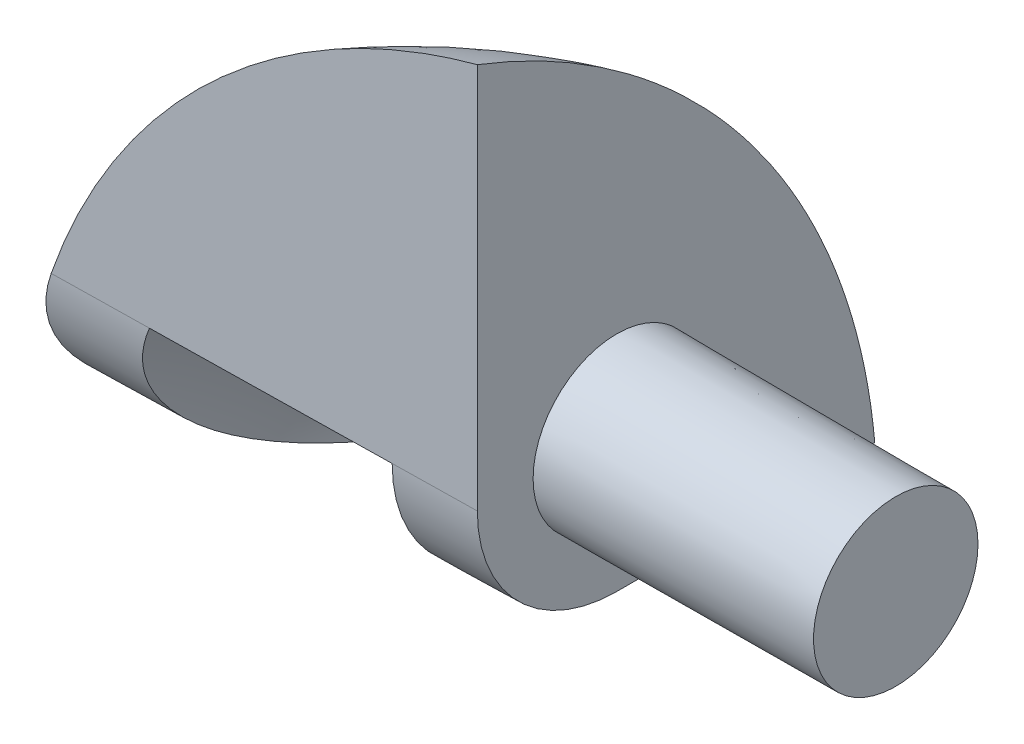
ISO-10303-21;
HEADER;
FILE_DESCRIPTION(('STEP AP214'),'2;1');
FILE_NAME('part.step','',(''),(''),'','','');
FILE_SCHEMA(('AUTOMOTIVE_DESIGN { 1 0 10303 214 1 1 1 1 }'));
ENDSEC;
DATA;
#1=APPLICATION_CONTEXT('core data for automotive mechanical design processes');
#2=APPLICATION_PROTOCOL_DEFINITION('international standard','automotive_design',2000,#1);
#3=PRODUCT_CONTEXT('',#1,'mechanical');
#4=PRODUCT('Part','Part','',(#3));
#5=PRODUCT_RELATED_PRODUCT_CATEGORY('part','',(#4));
#6=PRODUCT_DEFINITION_FORMATION('','',#4);
#7=PRODUCT_DEFINITION_CONTEXT('part definition',#1,'design');
#8=PRODUCT_DEFINITION('design','',#6,#7);
#9=PRODUCT_DEFINITION_SHAPE('','',#8);
#10=(LENGTH_UNIT() NAMED_UNIT(*) SI_UNIT(.MILLI.,.METRE.));
#11=(NAMED_UNIT(*) PLANE_ANGLE_UNIT() SI_UNIT($,.RADIAN.));
#12=(NAMED_UNIT(*) SI_UNIT($,.STERADIAN.) SOLID_ANGLE_UNIT());
#13=UNCERTAINTY_MEASURE_WITH_UNIT(LENGTH_MEASURE(1.E-05),#10,'distance_accuracy_value','');
#14=(GEOMETRIC_REPRESENTATION_CONTEXT(3) GLOBAL_UNCERTAINTY_ASSIGNED_CONTEXT((#13)) GLOBAL_UNIT_ASSIGNED_CONTEXT((#10,
#11,#12)) REPRESENTATION_CONTEXT('',''));
#15=CARTESIAN_POINT('',(0.,0.,0.));
#16=DIRECTION('',(0.,0.,1.));
#17=DIRECTION('',(1.,0.,0.));
#18=AXIS2_PLACEMENT_3D('',#15,#16,#17);
#19=CARTESIAN_POINT('',(-16.7,5.,-31.5));
#20=DIRECTION('',(-1.,0.,0.));
#21=DIRECTION('',(0.,0.,1.));
#22=AXIS2_PLACEMENT_3D('',#19,#20,#21);
#23=CONICAL_SURFACE('',#22,2.5,0.0174532925199433);
#24=CARTESIAN_POINT('',(-18.2,5.,-31.5));
#25=DIRECTION('',(-1.,0.,0.));
#26=DIRECTION('',(0.,0.,1.));
#27=AXIS2_PLACEMENT_3D('',#24,#25,#26);
#28=CIRCLE('',#27,2.52618259739233);
#29=CARTESIAN_POINT('',(-18.2,2.47381740260767,-31.5));
#30=VERTEX_POINT('',#29);
#31=CARTESIAN_POINT('',(-18.2,5.,-28.9738174026077));
#32=VERTEX_POINT('',#31);
#33=EDGE_CURVE('E191',#30,#32,#28,.T.);
#34=ORIENTED_EDGE('',*,*,#33,.F.);
#35=DIRECTION('',(-0.999847695156391,-0.0174524064372836,0.));
#36=VECTOR('',#35,1.);
#37=CARTESIAN_POINT('',(-16.7,2.5,-31.5));
#38=LINE('',#37,#36);
#39=CARTESIAN_POINT('',(-16.7,2.5,-31.5));
#40=VERTEX_POINT('',#39);
#41=EDGE_CURVE('E63',#30,#40,#38,.F.);
#42=ORIENTED_EDGE('',*,*,#41,.T.);
#43=CARTESIAN_POINT('',(-16.7,5.,-31.5));
#44=DIRECTION('',(-1.,0.,0.));
#45=DIRECTION('',(0.,0.,1.));
#46=AXIS2_PLACEMENT_3D('',#43,#44,#45);
#47=CIRCLE('',#46,2.5);
#48=CARTESIAN_POINT('',(-16.7,5.,-29.));
#49=VERTEX_POINT('',#48);
#50=EDGE_CURVE('E106',#40,#49,#47,.T.);
#51=ORIENTED_EDGE('',*,*,#50,.T.);
#52=DIRECTION('',(-0.999847695156391,0.,0.0174524064372835));
#53=VECTOR('',#52,1.);
#54=CARTESIAN_POINT('',(-16.7,5.,-29.));
#55=LINE('',#54,#53);
#56=EDGE_CURVE('E98',#32,#49,#55,.F.);
#57=ORIENTED_EDGE('',*,*,#56,.F.);
#58=EDGE_LOOP('',(#34,#42,#51,#57));
#59=FACE_BOUND('',#58,.T.);
#60=ADVANCED_FACE('F38',(#59),#23,.T.);
#61=CARTESIAN_POINT('',(-13.958082329,1.5,-25.));
#62=DIRECTION('',(0.,0.,1.));
#63=DIRECTION('',(1.,0.,0.));
#64=AXIS2_PLACEMENT_3D('',#61,#62,#63);
#65=SPHERICAL_SURFACE('',#64,11.5);
#66=CARTESIAN_POINT('',(-16.7,11.9274583425425,-28.9999999999999));
#67=CARTESIAN_POINT('',(-16.7,11.8149747360119,-29.2933238908898));
#68=CARTESIAN_POINT('',(-16.7,11.6900553163313,-29.5818722047106));
#69=CARTESIAN_POINT('',(-16.7,11.4163742320749,-30.1474155795178));
#70=CARTESIAN_POINT('',(-16.7,11.2676136755138,-30.4244111766622));
#71=CARTESIAN_POINT('',(-16.7,10.9474213463603,-30.9646177124004));
#72=CARTESIAN_POINT('',(-16.7,10.7760112637699,-31.2278415068803));
#73=CARTESIAN_POINT('',(-16.7,10.4116405578892,-31.7389187345353));
#74=CARTESIAN_POINT('',(-16.7,10.2186802492486,-31.9867723920439));
#75=CARTESIAN_POINT('',(-16.7,9.81249795059924,-32.465442631399));
#76=CARTESIAN_POINT('',(-16.7,9.59926831184079,-32.6962527229128));
#77=CARTESIAN_POINT('',(-16.7,9.15412050265844,-33.1390966828443));
#78=CARTESIAN_POINT('',(-16.7,8.92220192706654,-33.3511301439835));
#79=CARTESIAN_POINT('',(-16.7,8.44127459183763,-33.7549533422451));
#80=CARTESIAN_POINT('',(-16.7,8.19226201204363,-33.9467385298328));
#81=CARTESIAN_POINT('',(-16.7,7.67897278273781,-34.3086405349769));
#82=CARTESIAN_POINT('',(-16.7,7.41469667391919,-34.4787581194));
#83=CARTESIAN_POINT('',(-16.7,6.8725770992699,-34.7962256874369));
#84=CARTESIAN_POINT('',(-16.7,6.59472498254735,-34.9435608979827));
#85=CARTESIAN_POINT('',(-16.7,6.02759442693541,-35.2142792424057));
#86=CARTESIAN_POINT('',(-16.7,5.73831630339152,-35.3376630367612));
#87=CARTESIAN_POINT('',(-16.7,5.15074470468094,-35.5594723282225));
#88=CARTESIAN_POINT('',(-16.7,4.85246229506419,-35.6579271669966));
#89=CARTESIAN_POINT('',(-16.7,4.24878549795067,-35.8293324386908));
#90=CARTESIAN_POINT('',(-16.7,3.94339472432316,-35.9022955419721));
#91=CARTESIAN_POINT('',(-16.7,3.44765046985422,-35.9988730142085));
#92=CARTESIAN_POINT('',(-16.7,3.2588469553571,-36.0306378722156));
#93=CARTESIAN_POINT('',(-16.7,2.88018116477531,-36.0843808366644));
#94=CARTESIAN_POINT('',(-16.7,2.69032124793045,-36.106375566696));
#95=CARTESIAN_POINT('',(-16.7,2.5,-36.1234836038652));
#96=B_SPLINE_CURVE_WITH_KNOTS('',3,(#66,#67,#68,#69,#70,#71,#72,#73,#74,#75,#76,#77,#78,#79,#80,
#81,#82,#83,#84,#85,#86,#87,#88,#89,#90,#91,#92,#93,#94,#95),.UNSPECIFIED.,.F.,.F.,(4,2,2,2,2,2,
2,2,2,2,2,2,2,2,4),(0.,0.942168269487018,1.88429276448316,2.825521498708,3.76673649208155,
4.70830807911578,5.64990008450537,6.59170320564669,7.53347298491977,8.47585091006217,
9.41820284473481,10.3594404096497,11.3002094759421,11.8743493889636,12.4475086422601),.UNSPECIFIED.);
#97=CARTESIAN_POINT('',(-16.7,11.9274583425425,-29.));
#98=VERTEX_POINT('',#97);
#99=CARTESIAN_POINT('',(-16.7,2.5,-36.1234836038652));
#100=VERTEX_POINT('',#99);
#101=EDGE_CURVE('E111',#98,#100,#96,.T.);
#102=ORIENTED_EDGE('',*,*,#101,.T.);
#103=CARTESIAN_POINT('',(-16.7,2.5,-36.1234836038652));
#104=CARTESIAN_POINT('',(-16.8872452062743,2.49673162276698,-36.077620680697));
#105=CARTESIAN_POINT('',(-17.0732959099535,2.49348409565432,-36.0270382220764));
#106=CARTESIAN_POINT('',(-17.442617493587,2.48703756343261,-35.9165451328815));
#107=CARTESIAN_POINT('',(-17.6258882326112,2.4838385607835,-35.8566340311146));
#108=CARTESIAN_POINT('',(-18.1715121847469,2.47431465927258,-35.6628700770851));
#109=CARTESIAN_POINT('',(-18.5290599785377,2.46807363931702,-35.5151377863157));
#110=CARTESIAN_POINT('',(-19.1690859082112,2.45690194515883,-35.2119317735537));
#111=CARTESIAN_POINT('',(-19.4541465685392,2.45192619282432,-35.0618483491512));
#112=CARTESIAN_POINT('',(-20.0107431422891,2.44221076349069,-34.7381313182012));
#113=CARTESIAN_POINT('',(-20.2822742211107,2.43747117087983,-34.5644893747103));
#114=CARTESIAN_POINT('',(-20.8097016613319,2.42826489066585,-34.1949623104257));
#115=CARTESIAN_POINT('',(-21.0656001009276,2.42379816678768,-33.9990801561763));
#116=CARTESIAN_POINT('',(-21.5598808013197,2.41517046506956,-33.5865449391202));
#117=CARTESIAN_POINT('',(-21.798269641119,2.4110093723927,-33.3698997490043));
#118=CARTESIAN_POINT('',(-22.2818224875106,2.40256892606271,-32.891701784066));
#119=CARTESIAN_POINT('',(-22.5247182075281,2.39832916549902,-32.627839933715));
#120=CARTESIAN_POINT('',(-22.8694254690174,2.3923122778685,-32.2162141582252));
#121=CARTESIAN_POINT('',(-22.9809704984221,2.39036525213782,-32.0764895595169));
#122=CARTESIAN_POINT('',(-23.1973980452536,2.38658749525562,-31.7919764036784));
#123=CARTESIAN_POINT('',(-23.3022807333739,2.38475676112464,-31.6471879764343));
#124=CARTESIAN_POINT('',(-23.4037340229123,2.38298588736856,-31.5));
#125=B_SPLINE_CURVE_WITH_KNOTS('',3,(#103,#104,#105,#106,#107,#108,#109,#110,#111,#112,#113,
#114,#115,#116,#117,#118,#119,#120,#121,#122,#123,#124),.UNSPECIFIED.,.F.,.F.,(4,2,2,2,2,2,2,2,
2,2,4),(0.,0.578286557221905,1.15660233334581,2.31513173352243,3.28064642028605,
4.24650368120206,5.21223226080292,6.17759610435893,7.25183869306327,7.78806836159779,
8.3242842860378),.UNSPECIFIED.);
#126=CARTESIAN_POINT('',(-23.4037340229123,2.38298588736856,-31.5));
#127=VERTEX_POINT('',#126);
#128=EDGE_CURVE('E126',#100,#127,#125,.T.);
#129=ORIENTED_EDGE('',*,*,#128,.T.);
#130=CARTESIAN_POINT('',(-23.4037340229123,2.38298588736856,-31.5));
#131=CARTESIAN_POINT('',(-23.4527827392308,2.38213938022257,-31.428836156152));
#132=CARTESIAN_POINT('',(-23.5008444739339,2.38419683033693,-31.3569907497129));
#133=CARTESIAN_POINT('',(-23.594780722592,2.39448790662518,-31.2122007167748));
#134=CARTESIAN_POINT('',(-23.6406525183468,2.40272900643142,-31.1392548648878));
#135=CARTESIAN_POINT('',(-23.7749148998951,2.43738510924359,-30.9187226373568));
#136=CARTESIAN_POINT('',(-23.8594762120068,2.47374838065332,-30.7701315732489));
#137=CARTESIAN_POINT('',(-24.0014223127263,2.56632627347713,-30.5013624535778));
#138=CARTESIAN_POINT('',(-24.0609751982907,2.61797951799205,-30.3807438028091));
#139=CARTESIAN_POINT('',(-24.1687369069309,2.74156264235544,-30.1450507673087));
#140=CARTESIAN_POINT('',(-24.2169714323613,2.81344574973601,-30.029964302174));
#141=CARTESIAN_POINT('',(-24.2794516634236,2.93645310941198,-29.864276979857));
#142=CARTESIAN_POINT('',(-24.2986971040507,2.98021764065055,-29.8099765917054));
#143=CARTESIAN_POINT('',(-24.3335507522133,3.0726036615018,-29.7044429403565));
#144=CARTESIAN_POINT('',(-24.3491607948936,3.12122268278624,-29.6532081394029));
#145=CARTESIAN_POINT('',(-24.3765228688736,3.22305594253835,-29.5543821656061));
#146=CARTESIAN_POINT('',(-24.3882744231647,3.27627074813704,-29.5067914438223));
#147=CARTESIAN_POINT('',(-24.4077384079287,3.38685948176097,-29.4158436595324));
#148=CARTESIAN_POINT('',(-24.415451425025,3.4442328043559,-29.3724859828942));
#149=CARTESIAN_POINT('',(-24.4309285911549,3.60718538523691,-29.2597214954034));
#150=CARTESIAN_POINT('',(-24.4343907800481,3.71664089220356,-29.1951724066981));
#151=CARTESIAN_POINT('',(-24.428306759542,3.94344935145485,-29.0828901177299));
#152=CARTESIAN_POINT('',(-24.4187618624023,4.06080150592662,-29.0351552217273));
#153=CARTESIAN_POINT('',(-24.3879654712519,4.29369659118688,-28.959454152577));
#154=CARTESIAN_POINT('',(-24.3673140029209,4.40904373136801,-28.9306297677945));
#155=CARTESIAN_POINT('',(-24.3156069156726,4.64017971452942,-28.8891355855114));
#156=CARTESIAN_POINT('',(-24.2845646681771,4.75596780171608,-28.8764451261883));
#157=CARTESIAN_POINT('',(-24.2422019202093,4.89217749781347,-28.8704697802564));
#158=CARTESIAN_POINT('',(-24.2352903799775,4.91382683357402,-28.8697932256311));
#159=CARTESIAN_POINT('',(-24.2211543183433,4.95700055151172,-28.8689810258468));
#160=CARTESIAN_POINT('',(-24.2139302377448,4.97852506405308,-28.8688446424588));
#161=CARTESIAN_POINT('',(-24.2065480738307,5.,-28.8689727159845));
#162=B_SPLINE_CURVE_WITH_KNOTS('',3,(#130,#131,#132,#133,#134,#135,#136,#137,#138,#139,#140,
#141,#142,#143,#144,#145,#146,#147,#148,#149,#150,#151,#152,#153,#154,#155,#156,#157,#158,#159,
#160,#161),.UNSPECIFIED.,.F.,.F.,(4,2,2,2,2,2,2,2,2,2,2,2,2,2,2,4),(0.,0.259173587881905,
0.518660921604503,1.04012398649634,1.47075131257005,1.90039107251478,2.11717007883785,
2.33383941700997,2.55053553101812,2.76720015978991,3.14639592992247,3.525553446561,
3.88602774080967,4.24603992908952,4.31424499492393,4.38235681556486),.UNSPECIFIED.);
#163=CARTESIAN_POINT('',(-24.2065480738307,5.,-28.8689727159845));
#164=VERTEX_POINT('',#163);
#165=EDGE_CURVE('E152',#127,#164,#162,.T.);
#166=ORIENTED_EDGE('',*,*,#165,.T.);
#167=CARTESIAN_POINT('',(-24.2065480738307,5.,-28.8689727159845));
#168=CARTESIAN_POINT('',(-24.1409163307733,5.19093183028949,-28.8701183223209));
#169=CARTESIAN_POINT('',(-24.0699019755796,5.38001187342618,-28.8713578825017));
#170=CARTESIAN_POINT('',(-23.9173622675716,5.75387253722699,-28.8740204730091));
#171=CARTESIAN_POINT('',(-23.8358373777454,5.93865334684895,-28.8754434952542));
#172=CARTESIAN_POINT('',(-23.6625263068449,6.30333387018309,-28.8784686512496));
#173=CARTESIAN_POINT('',(-23.570740280212,6.48323365730944,-28.880070782304));
#174=CARTESIAN_POINT('',(-23.3773308374099,6.83734442788388,-28.8834467566858));
#175=CARTESIAN_POINT('',(-23.275720975064,7.01156281804577,-28.8852203634304));
#176=CARTESIAN_POINT('',(-23.0628779581472,7.35401746544034,-28.8889355521102));
#177=CARTESIAN_POINT('',(-22.9516449295223,7.52225380092414,-28.890877131847));
#178=CARTESIAN_POINT('',(-22.7199176955839,7.85220278329359,-28.894921945761));
#179=CARTESIAN_POINT('',(-22.59942358415,8.0139154962839,-28.8970251782996));
#180=CARTESIAN_POINT('',(-22.2869719275582,8.40953989096982,-28.9024790422523));
#181=CARTESIAN_POINT('',(-22.0894311202744,8.63907738558853,-28.9059271298694));
#182=CARTESIAN_POINT('',(-21.6756185560756,9.08080279680634,-28.9131502550456));
#183=CARTESIAN_POINT('',(-21.4593360202857,9.29298059116468,-28.9169254807507));
#184=CARTESIAN_POINT('',(-21.009703910905,9.69831620045957,-28.9247738384137));
#185=CARTESIAN_POINT('',(-20.7763577637937,9.89147781578456,-28.9288469105623));
#186=CARTESIAN_POINT('',(-20.2943408802493,10.257358561905,-28.9372605465611));
#187=CARTESIAN_POINT('',(-20.0456779657289,10.4300879974532,-28.9416009738793));
#188=CARTESIAN_POINT('',(-19.552371557452,10.7427845181482,-28.9502116692653));
#189=CARTESIAN_POINT('',(-19.3086385231492,10.884190990053,-28.9544660452042));
#190=CARTESIAN_POINT('',(-18.8108464809457,11.1474545064665,-28.9631550376216));
#191=CARTESIAN_POINT('',(-18.5567879738438,11.2693124976869,-28.9675896453586));
#192=CARTESIAN_POINT('',(-18.0396653967386,11.4928276617319,-28.9766160535178));
#193=CARTESIAN_POINT('',(-17.7765933651459,11.5944664060857,-28.9812079929101));
#194=CARTESIAN_POINT('',(-17.2432690056883,11.7768142660819,-28.9905172042322));
#195=CARTESIAN_POINT('',(-16.9730160291281,11.8575214837266,-28.9952344874851));
#196=CARTESIAN_POINT('',(-16.7,11.9274583425425,-29.));
#197=B_SPLINE_CURVE_WITH_KNOTS('',3,(#167,#168,#169,#170,#171,#172,#173,#174,#175,#176,#177,
#178,#179,#180,#181,#182,#183,#184,#185,#186,#187,#188,#189,#190,#191,#192,#193,#194,#195,#196),
.UNSPECIFIED.,.F.,.F.,(4,2,2,2,2,2,2,2,2,2,2,2,2,2,4),(0.,0.605620228519319,1.21121378863563,
1.81679823512394,2.42155877421638,3.02631139953673,3.63105789528587,4.53848470492544,
5.44643690874938,6.35420728814881,7.26151787339915,8.10610689494332,8.95065500160633,
9.79596936493327,10.6413603516442),.UNSPECIFIED.);
#198=EDGE_CURVE('E104',#164,#98,#197,.T.);
#199=ORIENTED_EDGE('',*,*,#198,.T.);
#200=EDGE_LOOP('',(#102,#129,#166,#199));
#201=FACE_BOUND('',#200,.T.);
#202=ADVANCED_FACE('F40',(#201),#65,.T.);
#203=CARTESIAN_POINT('',(-16.7,1.49999999999994,-24.9999999999999));
#204=DIRECTION('',(-1.,0.,0.));
#205=DIRECTION('',(0.,0.,1.));
#206=AXIS2_PLACEMENT_3D('',#203,#204,#205);
#207=PLANE('',#206);
#208=CARTESIAN_POINT('',(-16.7,5.,-31.5));
#209=DIRECTION('',(-1.,0.,0.));
#210=DIRECTION('',(0.,0.,1.));
#211=AXIS2_PLACEMENT_3D('',#208,#209,#210);
#212=CIRCLE('',#211,1.5);
#213=CARTESIAN_POINT('',(-16.7,5.,-30.));
#214=VERTEX_POINT('',#213);
#215=EDGE_CURVE('E11',#214,#214,#212,.F.);
#216=ORIENTED_EDGE('',*,*,#215,.F.);
#217=EDGE_LOOP('',(#216));
#218=FACE_BOUND('',#217,.T.);
#219=ORIENTED_EDGE('',*,*,#101,.F.);
#220=DIRECTION('',(0.,1.,0.));
#221=VECTOR('',#220,1.);
#222=CARTESIAN_POINT('',(-16.7,5.,-29.));
#223=LINE('',#222,#221);
#224=EDGE_CURVE('E95',#49,#98,#223,.T.);
#225=ORIENTED_EDGE('',*,*,#224,.F.);
#226=ORIENTED_EDGE('',*,*,#50,.F.);
#227=DIRECTION('',(0.,0.,1.));
#228=VECTOR('',#227,1.);
#229=CARTESIAN_POINT('',(-16.7,2.5,-36.1234836038652));
#230=LINE('',#229,#228);
#231=EDGE_CURVE('E47',#100,#40,#230,.T.);
#232=ORIENTED_EDGE('',*,*,#231,.F.);
#233=EDGE_LOOP('',(#219,#225,#226,#232));
#234=FACE_BOUND('',#233,.T.);
#235=ADVANCED_FACE('F109',(#218,#234),#207,.F.);
#236=CARTESIAN_POINT('',(-16.7,5.,-29.));
#237=DIRECTION('',(0.0174524064372835,0.,0.999847695156391));
#238=DIRECTION('',(0.999847695156391,0.,-0.0174524064372836));
#239=AXIS2_PLACEMENT_3D('',#236,#237,#238);
#240=PLANE('',#239);
#241=ORIENTED_EDGE('',*,*,#198,.F.);
#242=CARTESIAN_POINT('',(-22.475495682113,4.99999999999999,-28.8991883478761));
#243=VERTEX_POINT('',#242);
#244=EDGE_CURVE('E103',#164,#243,#55,.F.);
#245=ORIENTED_EDGE('',*,*,#244,.T.);
#246=DIRECTION('',(-0.999847695156391,0.,0.0174524064372835));
#247=VECTOR('',#246,1.);
#248=CARTESIAN_POINT('',(-16.7,5.,-29.));
#249=LINE('',#248,#247);
#250=EDGE_CURVE('E102',#243,#32,#249,.F.);
#251=ORIENTED_EDGE('',*,*,#250,.T.);
#252=ORIENTED_EDGE('',*,*,#56,.T.);
#253=ORIENTED_EDGE('',*,*,#224,.T.);
#254=EDGE_LOOP('',(#241,#245,#251,#252,#253));
#255=FACE_BOUND('',#254,.T.);
#256=ADVANCED_FACE('F99',(#255),#240,.T.);
#257=CARTESIAN_POINT('',(-21.5019946170281,2.41618087217482,-31.5));
#258=VERTEX_POINT('',#257);
#259=EDGE_CURVE('E107',#127,#258,#38,.F.);
#260=ORIENTED_EDGE('',*,*,#259,.T.);
#261=CARTESIAN_POINT('',(-21.5019946170281,2.41618087217482,-31.5));
#262=CARTESIAN_POINT('',(-21.7818116813577,2.4074659707164,-31.1798958378559));
#263=CARTESIAN_POINT('',(-22.0442483914631,2.46875454492175,-30.8196067243731));
#264=CARTESIAN_POINT('',(-22.3851657770192,2.70735908191712,-30.2532198990124));
#265=CARTESIAN_POINT('',(-22.4956158253154,2.83135020631474,-30.0408397312194));
#266=CARTESIAN_POINT('',(-22.6614049352204,3.15369986034612,-29.6463864459728));
#267=CARTESIAN_POINT('',(-22.7164135789713,3.35249467420466,-29.4645003580943));
#268=CARTESIAN_POINT('',(-22.7523234859087,3.77306213369534,-29.1892861332551));
#269=CARTESIAN_POINT('',(-22.7417385813703,3.98872313987716,-29.0876522275608));
#270=CARTESIAN_POINT('',(-22.6706208718948,4.41981299448197,-28.9516924034619));
#271=CARTESIAN_POINT('',(-22.6126402917912,4.63470236793792,-28.9142234241961));
#272=CARTESIAN_POINT('',(-22.5173540884124,4.89593154465526,-28.8999747427199));
#273=CARTESIAN_POINT('',(-22.4969602801363,4.94826230254953,-28.8987680123767));
#274=CARTESIAN_POINT('',(-22.475495682113,4.99999999999999,-28.8991883478761));
#275=B_SPLINE_CURVE_WITH_KNOTS('',3,(#261,#262,#263,#264,#265,#266,#267,#268,#269,#270,#271,
#272,#273,#274),.UNSPECIFIED.,.F.,.F.,(4,2,2,2,2,2,4),(0.,1.29190833492842,2.08984047789364,
2.89250047973878,3.59336373129673,4.25879407537636,4.42712452136552),.UNSPECIFIED.);
#276=EDGE_CURVE('E164',#258,#243,#275,.T.);
#277=ORIENTED_EDGE('',*,*,#276,.T.);
#278=ORIENTED_EDGE('',*,*,#244,.F.);
#279=ORIENTED_EDGE('',*,*,#165,.F.);
#280=EDGE_LOOP('',(#260,#277,#278,#279));
#281=FACE_BOUND('',#280,.T.);
#282=ADVANCED_FACE('F143',(#281),#23,.T.);
#283=CARTESIAN_POINT('',(-16.7,2.5,-36.1234836038652));
#284=DIRECTION('',(0.0174524064372835,-0.999847695156391,0.));
#285=DIRECTION('',(0.999847695156391,0.0174524064372836,0.));
#286=AXIS2_PLACEMENT_3D('',#283,#284,#285);
#287=PLANE('',#286);
#288=DIRECTION('',(0.,0.,-1.));
#289=VECTOR('',#288,1.);
#290=CARTESIAN_POINT('',(-18.2,2.47381740260767,-36.1234836038652));
#291=LINE('',#290,#289);
#292=CARTESIAN_POINT('',(-18.2,2.47381740260767,-34.0032113236798));
#293=VERTEX_POINT('',#292);
#294=EDGE_CURVE('E247',#293,#30,#291,.F.);
#295=ORIENTED_EDGE('',*,*,#294,.F.);
#296=CARTESIAN_POINT('',(-22.0127525030782,2.40726556011122,-30.8565482658517));
#297=CARTESIAN_POINT('',(-21.3217344806232,2.41932732455974,-31.7871677568244));
#298=CARTESIAN_POINT('',(-20.5246425779682,2.43324061547434,-32.5639520794253));
#299=CARTESIAN_POINT('',(-18.7183110122581,2.46477025023569,-33.8098503878834));
#300=CARTESIAN_POINT('',(-17.7090713492031,2.48238659408245,-34.2789643737406));
#301=CARTESIAN_POINT('',(-16.5937578059481,2.50185446439529,-34.594243191226));
#302=B_SPLINE_CURVE_WITH_KNOTS('',3,(#296,#297,#298,#299,#300,#301),.UNSPECIFIED.,.F.,.F.,(4,2,
4),(0.,3.33923444565174,6.67846889130348),.UNSPECIFIED.);
#303=EDGE_CURVE('E170',#293,#258,#302,.F.);
#304=ORIENTED_EDGE('',*,*,#303,.T.);
#305=ORIENTED_EDGE('',*,*,#259,.F.);
#306=ORIENTED_EDGE('',*,*,#128,.F.);
#307=ORIENTED_EDGE('',*,*,#231,.T.);
#308=ORIENTED_EDGE('',*,*,#41,.F.);
#309=EDGE_LOOP('',(#295,#304,#305,#306,#307,#308));
#310=FACE_BOUND('',#309,.T.);
#311=ADVANCED_FACE('F139',(#310),#287,.T.);
#312=CARTESIAN_POINT('',(-16.7,5.,-31.5));
#313=DIRECTION('',(-1.,0.,0.));
#314=DIRECTION('',(0.,0.,-1.));
#315=AXIS2_PLACEMENT_3D('',#312,#313,#314);
#316=CONICAL_SURFACE('',#315,1.5,0.005235987755983);
#317=CARTESIAN_POINT('',(-11.7,5.,-31.5));
#318=DIRECTION('',(1.,0.,0.));
#319=DIRECTION('',(0.,0.,-1.));
#320=AXIS2_PLACEMENT_3D('',#317,#318,#319);
#321=CIRCLE('',#320,1.4738198219715);
#322=CARTESIAN_POINT('',(-11.7,5.,-32.9738198219715));
#323=VERTEX_POINT('',#322);
#324=EDGE_CURVE('E116',#323,#323,#321,.T.);
#325=ORIENTED_EDGE('',*,*,#324,.F.);
#326=EDGE_LOOP('',(#325));
#327=FACE_BOUND('',#326,.T.);
#328=ORIENTED_EDGE('',*,*,#215,.T.);
#329=EDGE_LOOP('',(#328));
#330=FACE_BOUND('',#329,.T.);
#331=ADVANCED_FACE('F137',(#327,#330),#316,.T.);
#332=CARTESIAN_POINT('',(-11.7,5.,-31.5));
#333=DIRECTION('',(1.,0.,0.));
#334=DIRECTION('',(0.,0.,-1.));
#335=AXIS2_PLACEMENT_3D('',#332,#333,#334);
#336=PLANE('',#335);
#337=ORIENTED_EDGE('',*,*,#324,.T.);
#338=EDGE_LOOP('',(#337));
#339=FACE_BOUND('',#338,.T.);
#340=ADVANCED_FACE('F233',(#339),#336,.T.);
#341=CARTESIAN_POINT('',(-16.7,5.,-29.));
#342=DIRECTION('',(0.,1.,0.));
#343=DIRECTION('',(-0.999847695156391,0.,0.0174524064372835));
#344=AXIS2_PLACEMENT_3D('',#341,#342,#343);
#345=PLANE('',#344);
#346=ORIENTED_EDGE('',*,*,#250,.F.);
#347=CARTESIAN_POINT('',(-21.6021284172571,5.,-30.4146615222562));
#348=CARTESIAN_POINT('',(-22.2091847976138,5.,-29.5564563365036));
#349=CARTESIAN_POINT('',(-22.6729947491403,5.,-28.5922145609624));
#350=CARTESIAN_POINT('',(-23.2540203488889,4.99999999999999,-26.5662024856615));
#351=CARTESIAN_POINT('',(-23.3712359971111,4.99999999999999,-25.5044321859018));
#352=CARTESIAN_POINT('',(-23.2479506032991,4.99999999999998,-23.4015064713377));
#353=CARTESIAN_POINT('',(-23.0074495612647,4.99999999999998,-22.3603510565332));
#354=CARTESIAN_POINT('',(-22.1952846941455,4.99999999999998,-20.416456328432));
#355=CARTESIAN_POINT('',(-21.6236208690605,4.99999999999997,-19.5137170151351));
#356=CARTESIAN_POINT('',(-20.2137314510007,4.99999999999997,-17.9483192714992));
#357=CARTESIAN_POINT('',(-19.3755058580258,4.99999999999998,-17.28566084116));
#358=CARTESIAN_POINT('',(-17.5269562205701,4.99999999999996,-16.2751646458484));
#359=CARTESIAN_POINT('',(-16.5166321760892,4.99999999999992,-15.9273268808761));
#360=CARTESIAN_POINT('',(-14.43780279476,4.99999999999992,-15.5856800292226));
#361=CARTESIAN_POINT('',(-13.3692974579115,4.99999999999996,-15.5918709425414));
#362=CARTESIAN_POINT('',(-11.2945684750049,4.99999999999998,-15.957585623651));
#363=CARTESIAN_POINT('',(-10.2883448289468,4.99999999999997,-16.3171093914417));
#364=CARTESIAN_POINT('',(-8.45162407613429,4.99999999999997,-17.3489556416217));
#365=CARTESIAN_POINT('',(-7.62112696937993,4.99999999999997,-18.0212781240111));
#366=CARTESIAN_POINT('',(-6.22949137059358,4.99999999999998,-19.6029226381436));
#367=CARTESIAN_POINT('',(-5.6683528785616,4.99999999999998,-20.5122446698868));
#368=CARTESIAN_POINT('',(-4.87869854581067,4.99999999999998,-22.46536930559));
#369=CARTESIAN_POINT('',(-4.65018270509172,4.99999999999999,-23.5091719095499));
#370=CARTESIAN_POINT('',(-4.55153756285567,4.99999999999999,-25.6135760333828));
#371=CARTESIAN_POINT('',(-4.68140826133857,4.99999999999999,-26.6741775532557));
#372=CARTESIAN_POINT('',(-5.28489249188868,5.,-28.692607871944));
#373=CARTESIAN_POINT('',(-5.7585060239559,5.,-29.6504366707593));
#374=CARTESIAN_POINT('',(-6.99608620646426,5.,-31.3553218911596));
#375=CARTESIAN_POINT('',(-7.7600528569054,5.,-32.1023783127446));
#376=CARTESIAN_POINT('',(-9.49218312987573,5.,-33.3015375950743));
#377=CARTESIAN_POINT('',(-10.4603467524049,5.00000000000001,-33.753640455819));
#378=CARTESIAN_POINT('',(-12.4918100544192,5.00000000000001,-34.3117581296943));
#379=CARTESIAN_POINT('',(-13.5551097339043,5.00000000000002,-34.4177729428249));
#380=CARTESIAN_POINT('',(-15.6566221224134,5.00000000000002,-34.2723716696344));
#381=CARTESIAN_POINT('',(-16.6948348314373,5.00000000000002,-34.0209555833133));
#382=CARTESIAN_POINT('',(-18.6304067006247,5.00000000000001,-33.1867630299788));
#383=CARTESIAN_POINT('',(-19.5277658607881,5.00000000000001,-32.6039865629653));
#384=CARTESIAN_POINT('',(-20.7861206300417,5.,-31.4473975156965));
#385=CARTESIAN_POINT('',(-21.2221815414401,5.,-30.9517984170945));
#386=CARTESIAN_POINT('',(-21.6021284172571,5.,-30.4146615222562));
#387=B_SPLINE_CURVE_WITH_KNOTS('',3,(#347,#348,#349,#350,#351,#352,#353,#354,#355,#356,#357,
#358,#359,#360,#361,#362,#363,#364,#365,#366,#367,#368,#369,#370,#371,#372,#373,#374,#375,#376,
#377,#378,#379,#380,#381,#382,#383,#384,#385,#386),.UNSPECIFIED.,.T.,.F.,(4,2,2,2,2,2,2,2,2,2,2,
2,2,2,2,2,2,2,2,4),(0.,3.14533731889073,6.29067463778146,9.43601195667219,12.5813492755629,
15.7266865944536,18.8720239133444,22.0173612322351,25.1626985511258,28.3080358700166,
31.4533731889073,34.598710507798,37.7440478266888,40.8893851455795,44.0347224644702,
47.180059783361,50.3253971022517,53.4707344211424,56.6160717400331,58.5846880438447),.UNSPECIFIED.);
#388=CARTESIAN_POINT('',(-21.6021284172571,5.,-30.4146615222562));
#389=VERTEX_POINT('',#388);
#390=EDGE_CURVE('E235',#389,#243,#387,.T.);
#391=ORIENTED_EDGE('',*,*,#390,.F.);
#392=DIRECTION('',(-0.999847695156391,0.,0.0174524064372836));
#393=VECTOR('',#392,1.);
#394=CARTESIAN_POINT('',(-16.7261786096559,5.,-30.4997715427346));
#395=LINE('',#394,#393);
#396=CARTESIAN_POINT('',(-18.2,5.,-30.4740458946735));
#397=VERTEX_POINT('',#396);
#398=EDGE_CURVE('E199',#389,#397,#395,.F.);
#399=ORIENTED_EDGE('',*,*,#398,.T.);
#400=DIRECTION('',(0.,0.,1.));
#401=VECTOR('',#400,1.);
#402=CARTESIAN_POINT('',(-18.2,5.,-29.));
#403=LINE('',#402,#401);
#404=EDGE_CURVE('E186',#397,#32,#403,.T.);
#405=ORIENTED_EDGE('',*,*,#404,.T.);
#406=EDGE_LOOP('',(#346,#391,#399,#405));
#407=FACE_BOUND('',#406,.T.);
#408=ADVANCED_FACE('F221',(#407),#345,.F.);
#409=CARTESIAN_POINT('',(-13.958082329,1.5,-25.));
#410=DIRECTION('',(0.,0.,1.));
#411=DIRECTION('',(1.,0.,0.));
#412=AXIS2_PLACEMENT_3D('',#409,#410,#411);
#413=SPHERICAL_SURFACE('',#412,11.5);
#414=OFFSET_SURFACE('',#413,-1.5,.F.);
#415=CARTESIAN_POINT('',(-18.2,8.71394178070948,-30.4740458946735));
#416=CARTESIAN_POINT('',(-18.2,8.10479839855524,-31.2916656776821));
#417=CARTESIAN_POINT('',(-18.2,7.34700314436876,-31.9934590132739));
#418=CARTESIAN_POINT('',(-18.2,5.64368361185945,-33.1131857508277));
#419=CARTESIAN_POINT('',(-18.2,4.69815933353662,-33.5311191527896));
#420=CARTESIAN_POINT('',(-18.2,3.30571788717997,-33.8845322084451));
#421=CARTESIAN_POINT('',(-18.2,2.89117313573432,-33.9592146884335));
#422=CARTESIAN_POINT('',(-18.2,2.47381740260767,-34.0032113236798));
#423=B_SPLINE_CURVE_WITH_KNOTS('',3,(#415,#416,#417,#418,#419,#420,#421,#422),.UNSPECIFIED.,.F.,
.F.,(4,2,2,4),(0.,3.0406528218392,6.0813056436784,7.34079994967177),.UNSPECIFIED.);
#424=CARTESIAN_POINT('',(-18.2,8.71394178070948,-30.4740458946735));
#425=VERTEX_POINT('',#424);
#426=EDGE_CURVE('E54',#425,#293,#423,.T.);
#427=ORIENTED_EDGE('',*,*,#426,.F.);
#428=CARTESIAN_POINT('',(-21.6021284172571,5.,-30.4146615222562));
#429=CARTESIAN_POINT('',(-21.1878809914789,5.87442089287971,-30.4218922379695));
#430=CARTESIAN_POINT('',(-20.6599510669159,6.64150680864561,-30.4311072890803));
#431=CARTESIAN_POINT('',(-19.4894669205146,7.84508078284691,-30.4515381658532));
#432=CARTESIAN_POINT('',(-18.8833540393252,8.31597546065085,-30.4621179055482));
#433=CARTESIAN_POINT('',(-18.2,8.71394178070948,-30.4740458946735));
#434=B_SPLINE_CURVE_WITH_KNOTS('',3,(#428,#429,#430,#431,#432,#433),.UNSPECIFIED.,.F.,.F.,(4,2,
4),(0.,2.79373254289707,5.09656535901245),.UNSPECIFIED.);
#435=EDGE_CURVE('E196',#389,#425,#434,.T.);
#436=ORIENTED_EDGE('',*,*,#435,.F.);
#437=ORIENTED_EDGE('',*,*,#390,.T.);
#438=ORIENTED_EDGE('',*,*,#276,.F.);
#439=ORIENTED_EDGE('',*,*,#303,.F.);
#440=EDGE_LOOP('',(#427,#436,#437,#438,#439));
#441=FACE_BOUND('',#440,.T.);
#442=ADVANCED_FACE('F195',(#441),#414,.F.);
#443=CARTESIAN_POINT('',(-18.2,1.49999999999994,-24.9999999999999));
#444=DIRECTION('',(-1.,0.,0.));
#445=DIRECTION('',(0.,0.,1.));
#446=AXIS2_PLACEMENT_3D('',#443,#444,#445);
#447=PLANE('',#446);
#448=CARTESIAN_POINT('',(-18.2,5.,-31.5));
#449=DIRECTION('',(-1.,0.,0.));
#450=DIRECTION('',(0.,0.,1.));
#451=AXIS2_PLACEMENT_3D('',#448,#449,#450);
#452=CIRCLE('',#451,0.00783349149783675);
#453=CARTESIAN_POINT('',(-18.2,5.,-31.4921665085022));
#454=VERTEX_POINT('',#453);
#455=EDGE_CURVE('E215',#454,#454,#452,.F.);
#456=ORIENTED_EDGE('',*,*,#455,.T.);
#457=EDGE_LOOP('',(#456));
#458=FACE_BOUND('',#457,.T.);
#459=ORIENTED_EDGE('',*,*,#426,.T.);
#460=ORIENTED_EDGE('',*,*,#294,.T.);
#461=ORIENTED_EDGE('',*,*,#33,.T.);
#462=ORIENTED_EDGE('',*,*,#404,.F.);
#463=DIRECTION('',(0.,-1.,0.));
#464=VECTOR('',#463,1.);
#465=CARTESIAN_POINT('',(-18.2,5.,-30.4740458946735));
#466=LINE('',#465,#464);
#467=EDGE_CURVE('E184',#397,#425,#466,.F.);
#468=ORIENTED_EDGE('',*,*,#467,.T.);
#469=EDGE_LOOP('',(#459,#460,#461,#462,#468));
#470=FACE_BOUND('',#469,.T.);
#471=ADVANCED_FACE('F185',(#458,#470),#447,.T.);
#472=CARTESIAN_POINT('',(-16.7261786096559,5.,-30.4997715427346));
#473=DIRECTION('',(0.0174524064372835,0.,0.999847695156391));
#474=DIRECTION('',(0.999847695156391,0.,-0.0174524064372836));
#475=AXIS2_PLACEMENT_3D('',#472,#473,#474);
#476=PLANE('',#475);
#477=ORIENTED_EDGE('',*,*,#435,.T.);
#478=ORIENTED_EDGE('',*,*,#467,.F.);
#479=ORIENTED_EDGE('',*,*,#398,.F.);
#480=EDGE_LOOP('',(#477,#478,#479));
#481=FACE_BOUND('',#480,.T.);
#482=ADVANCED_FACE('F198',(#481),#476,.F.);
#483=CARTESIAN_POINT('',(-16.7078539457471,5.,-31.5));
#484=DIRECTION('',(-1.,0.,0.));
#485=DIRECTION('',(0.,0.,-1.));
#486=AXIS2_PLACEMENT_3D('',#483,#484,#485);
#487=CONICAL_SURFACE('',#486,2.05616288637394E-05,0.005235987755983);
#488=CARTESIAN_POINT('',(-16.703926999788,5.,-31.5));
#489=VERTEX_POINT('',#488);
#490=VERTEX_LOOP('',#489);
#491=FACE_BOUND('',#490,.T.);
#492=ORIENTED_EDGE('',*,*,#455,.F.);
#493=EDGE_LOOP('',(#492));
#494=FACE_BOUND('',#493,.T.);
#495=ADVANCED_FACE('F258',(#491,#494),#487,.F.);
#496=CLOSED_SHELL('',(#60,#202,#235,#256,#282,#311,#331,#340,#408,#442,#471,#482,#495));
#497=MANIFOLD_SOLID_BREP('B2',#496);
#498=ADVANCED_BREP_SHAPE_REPRESENTATION('',(#18,#497),#14);
#499=SHAPE_DEFINITION_REPRESENTATION(#9,#498);
ENDSEC;
END-ISO-10303-21;
